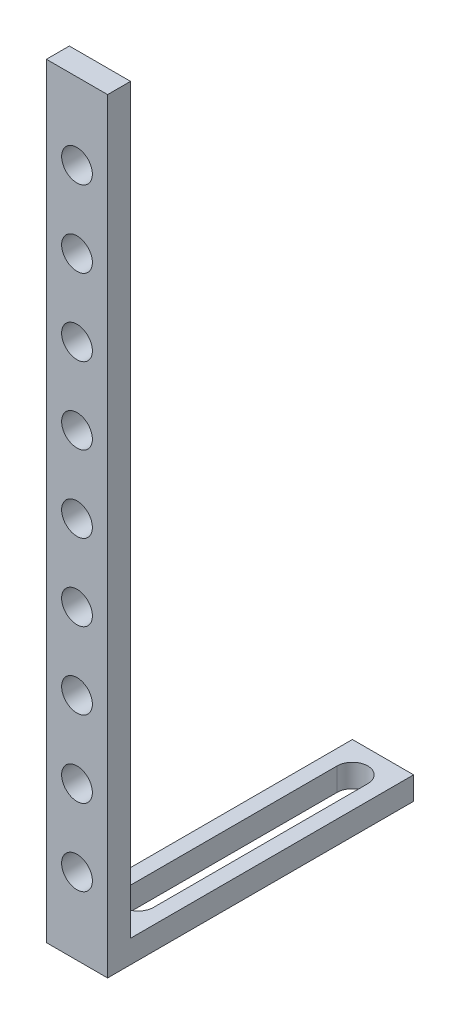
ISO-10303-21;
HEADER;
FILE_DESCRIPTION(('STEP AP214'),'2;1');
FILE_NAME('part.step','',(''),(''),'','','');
FILE_SCHEMA(('AUTOMOTIVE_DESIGN { 1 0 10303 214 1 1 1 1 }'));
ENDSEC;
DATA;
#1=APPLICATION_CONTEXT('core data for automotive mechanical design processes');
#2=APPLICATION_PROTOCOL_DEFINITION('international standard','automotive_design',2000,#1);
#3=PRODUCT_CONTEXT('',#1,'mechanical');
#4=PRODUCT('Part','Part','',(#3));
#5=PRODUCT_RELATED_PRODUCT_CATEGORY('part','',(#4));
#6=PRODUCT_DEFINITION_FORMATION('','',#4);
#7=PRODUCT_DEFINITION_CONTEXT('part definition',#1,'design');
#8=PRODUCT_DEFINITION('design','',#6,#7);
#9=PRODUCT_DEFINITION_SHAPE('','',#8);
#10=(LENGTH_UNIT() NAMED_UNIT(*) SI_UNIT(.MILLI.,.METRE.));
#11=(NAMED_UNIT(*) PLANE_ANGLE_UNIT() SI_UNIT($,.RADIAN.));
#12=(NAMED_UNIT(*) SI_UNIT($,.STERADIAN.) SOLID_ANGLE_UNIT());
#13=UNCERTAINTY_MEASURE_WITH_UNIT(LENGTH_MEASURE(1.E-05),#10,'distance_accuracy_value','');
#14=(GEOMETRIC_REPRESENTATION_CONTEXT(3) GLOBAL_UNCERTAINTY_ASSIGNED_CONTEXT((#13)) GLOBAL_UNIT_ASSIGNED_CONTEXT((#10,
#11,#12)) REPRESENTATION_CONTEXT('',''));
#15=CARTESIAN_POINT('',(0.,0.,0.));
#16=DIRECTION('',(0.,0.,1.));
#17=DIRECTION('',(1.,0.,0.));
#18=AXIS2_PLACEMENT_3D('',#15,#16,#17);
#19=CARTESIAN_POINT('',(40.,0.,-200.));
#20=DIRECTION('',(0.,1.,0.));
#21=DIRECTION('',(0.,0.,1.));
#22=AXIS2_PLACEMENT_3D('',#19,#20,#21);
#23=PLANE('',#22);
#24=DIRECTION('',(0.,0.,-1.));
#25=VECTOR('',#24,1.);
#26=CARTESIAN_POINT('',(9.95,0.,-40.));
#27=LINE('',#26,#25);
#28=CARTESIAN_POINT('',(9.95,0.,-40.));
#29=VERTEX_POINT('',#28);
#30=CARTESIAN_POINT('',(9.95000000000001,0.,-180.));
#31=VERTEX_POINT('',#30);
#32=EDGE_CURVE('E132',#29,#31,#27,.T.);
#33=ORIENTED_EDGE('',*,*,#32,.F.);
#34=CARTESIAN_POINT('',(20.,0.,-40.));
#35=DIRECTION('',(0.,-1.,0.));
#36=DIRECTION('',(0.,0.,1.));
#37=AXIS2_PLACEMENT_3D('',#34,#35,#36);
#38=CIRCLE('',#37,10.05);
#39=CARTESIAN_POINT('',(30.05,0.,-40.));
#40=VERTEX_POINT('',#39);
#41=EDGE_CURVE('E48',#40,#29,#38,.T.);
#42=ORIENTED_EDGE('',*,*,#41,.F.);
#43=DIRECTION('',(0.,0.,1.));
#44=VECTOR('',#43,1.);
#45=CARTESIAN_POINT('',(30.05,0.,-40.));
#46=LINE('',#45,#44);
#47=CARTESIAN_POINT('',(30.05,0.,-180.));
#48=VERTEX_POINT('',#47);
#49=EDGE_CURVE('E118',#48,#40,#46,.T.);
#50=ORIENTED_EDGE('',*,*,#49,.F.);
#51=CARTESIAN_POINT('',(20.,0.,-180.));
#52=DIRECTION('',(0.,-1.,0.));
#53=DIRECTION('',(0.,0.,-1.));
#54=AXIS2_PLACEMENT_3D('',#51,#52,#53);
#55=CIRCLE('',#54,10.05);
#56=EDGE_CURVE('E138',#31,#48,#55,.T.);
#57=ORIENTED_EDGE('',*,*,#56,.F.);
#58=EDGE_LOOP('',(#33,#42,#50,#57));
#59=FACE_BOUND('',#58,.T.);
#60=DIRECTION('',(0.,0.,-1.));
#61=VECTOR('',#60,1.);
#62=CARTESIAN_POINT('',(0.,0.,-200.));
#63=LINE('',#62,#61);
#64=CARTESIAN_POINT('',(0.,0.,0.));
#65=VERTEX_POINT('',#64);
#66=CARTESIAN_POINT('',(0.,0.,-200.));
#67=VERTEX_POINT('',#66);
#68=EDGE_CURVE('E200',#65,#67,#63,.T.);
#69=ORIENTED_EDGE('',*,*,#68,.T.);
#70=DIRECTION('',(-1.,0.,0.));
#71=VECTOR('',#70,1.);
#72=CARTESIAN_POINT('',(40.,0.,-200.));
#73=LINE('',#72,#71);
#74=CARTESIAN_POINT('',(40.,0.,-200.));
#75=VERTEX_POINT('',#74);
#76=EDGE_CURVE('E11',#75,#67,#73,.T.);
#77=ORIENTED_EDGE('',*,*,#76,.F.);
#78=DIRECTION('',(0.,0.,-1.));
#79=VECTOR('',#78,1.);
#80=CARTESIAN_POINT('',(40.,0.,-200.));
#81=LINE('',#80,#79);
#82=CARTESIAN_POINT('',(40.,0.,0.));
#83=VERTEX_POINT('',#82);
#84=EDGE_CURVE('E201',#83,#75,#81,.T.);
#85=ORIENTED_EDGE('',*,*,#84,.F.);
#86=DIRECTION('',(-1.,0.,0.));
#87=VECTOR('',#86,1.);
#88=CARTESIAN_POINT('',(40.,0.,0.));
#89=LINE('',#88,#87);
#90=EDGE_CURVE('E215',#83,#65,#89,.T.);
#91=ORIENTED_EDGE('',*,*,#90,.T.);
#92=EDGE_LOOP('',(#69,#77,#85,#91));
#93=FACE_BOUND('',#92,.T.);
#94=ADVANCED_FACE('F34',(#59,#93),#23,.F.);
#95=CARTESIAN_POINT('',(40.,15.,-200.));
#96=DIRECTION('',(0.,0.,1.));
#97=DIRECTION('',(1.,0.,0.));
#98=AXIS2_PLACEMENT_3D('',#95,#96,#97);
#99=PLANE('',#98);
#100=DIRECTION('',(0.,1.,0.));
#101=VECTOR('',#100,1.);
#102=CARTESIAN_POINT('',(0.,15.,-200.));
#103=LINE('',#102,#101);
#104=CARTESIAN_POINT('',(0.,15.,-200.));
#105=VERTEX_POINT('',#104);
#106=EDGE_CURVE('E218',#67,#105,#103,.T.);
#107=ORIENTED_EDGE('',*,*,#106,.T.);
#108=DIRECTION('',(-1.,0.,0.));
#109=VECTOR('',#108,1.);
#110=CARTESIAN_POINT('',(40.,15.,-200.));
#111=LINE('',#110,#109);
#112=CARTESIAN_POINT('',(40.,15.,-200.));
#113=VERTEX_POINT('',#112);
#114=EDGE_CURVE('E41',#113,#105,#111,.T.);
#115=ORIENTED_EDGE('',*,*,#114,.F.);
#116=DIRECTION('',(0.,1.,0.));
#117=VECTOR('',#116,1.);
#118=CARTESIAN_POINT('',(40.,15.,-200.));
#119=LINE('',#118,#117);
#120=EDGE_CURVE('E204',#75,#113,#119,.T.);
#121=ORIENTED_EDGE('',*,*,#120,.F.);
#122=ORIENTED_EDGE('',*,*,#76,.T.);
#123=EDGE_LOOP('',(#107,#115,#121,#122));
#124=FACE_BOUND('',#123,.T.);
#125=ADVANCED_FACE('F263',(#124),#99,.F.);
#126=CARTESIAN_POINT('',(40.,15.,-15.0000000000001));
#127=DIRECTION('',(0.,-1.,0.));
#128=DIRECTION('',(0.,0.,-1.));
#129=AXIS2_PLACEMENT_3D('',#126,#127,#128);
#130=PLANE('',#129);
#131=DIRECTION('',(0.,0.,-1.));
#132=VECTOR('',#131,1.);
#133=CARTESIAN_POINT('',(30.05,15.,-40.));
#134=LINE('',#133,#132);
#135=CARTESIAN_POINT('',(30.05,15.,-40.));
#136=VERTEX_POINT('',#135);
#137=CARTESIAN_POINT('',(30.05,15.,-180.));
#138=VERTEX_POINT('',#137);
#139=EDGE_CURVE('E130',#136,#138,#134,.T.);
#140=ORIENTED_EDGE('',*,*,#139,.F.);
#141=CARTESIAN_POINT('',(20.,15.,-40.));
#142=DIRECTION('',(0.,-1.,0.));
#143=DIRECTION('',(0.,0.,-1.));
#144=AXIS2_PLACEMENT_3D('',#141,#142,#143);
#145=CIRCLE('',#144,10.05);
#146=CARTESIAN_POINT('',(9.95,15.,-40.));
#147=VERTEX_POINT('',#146);
#148=EDGE_CURVE('E112',#147,#136,#145,.F.);
#149=ORIENTED_EDGE('',*,*,#148,.F.);
#150=DIRECTION('',(0.,0.,1.));
#151=VECTOR('',#150,1.);
#152=CARTESIAN_POINT('',(9.95,15.,-40.));
#153=LINE('',#152,#151);
#154=CARTESIAN_POINT('',(9.95000000000001,15.,-180.));
#155=VERTEX_POINT('',#154);
#156=EDGE_CURVE('E121',#155,#147,#153,.T.);
#157=ORIENTED_EDGE('',*,*,#156,.F.);
#158=CARTESIAN_POINT('',(20.,15.,-180.));
#159=DIRECTION('',(0.,-1.,0.));
#160=DIRECTION('',(0.,0.,-1.));
#161=AXIS2_PLACEMENT_3D('',#158,#159,#160);
#162=CIRCLE('',#161,10.05);
#163=EDGE_CURVE('E56',#138,#155,#162,.F.);
#164=ORIENTED_EDGE('',*,*,#163,.F.);
#165=EDGE_LOOP('',(#140,#149,#157,#164));
#166=FACE_BOUND('',#165,.T.);
#167=DIRECTION('',(0.,0.,1.));
#168=VECTOR('',#167,1.);
#169=CARTESIAN_POINT('',(0.,15.,-15.0000000000001));
#170=LINE('',#169,#168);
#171=CARTESIAN_POINT('',(0.,15.,-15.0000000000001));
#172=VERTEX_POINT('',#171);
#173=EDGE_CURVE('E220',#105,#172,#170,.T.);
#174=ORIENTED_EDGE('',*,*,#173,.T.);
#175=DIRECTION('',(-1.,0.,0.));
#176=VECTOR('',#175,1.);
#177=CARTESIAN_POINT('',(40.,15.,-15.0000000000001));
#178=LINE('',#177,#176);
#179=CARTESIAN_POINT('',(40.,15.,-15.0000000000001));
#180=VERTEX_POINT('',#179);
#181=EDGE_CURVE('E235',#180,#172,#178,.T.);
#182=ORIENTED_EDGE('',*,*,#181,.F.);
#183=DIRECTION('',(0.,0.,1.));
#184=VECTOR('',#183,1.);
#185=CARTESIAN_POINT('',(40.,15.,-15.0000000000001));
#186=LINE('',#185,#184);
#187=EDGE_CURVE('E207',#113,#180,#186,.T.);
#188=ORIENTED_EDGE('',*,*,#187,.F.);
#189=ORIENTED_EDGE('',*,*,#114,.T.);
#190=EDGE_LOOP('',(#174,#182,#188,#189));
#191=FACE_BOUND('',#190,.T.);
#192=ADVANCED_FACE('F127',(#166,#191),#130,.F.);
#193=CARTESIAN_POINT('',(40.,500.,-15.));
#194=DIRECTION('',(0.,0.,1.));
#195=DIRECTION('',(0.,-1.,0.));
#196=AXIS2_PLACEMENT_3D('',#193,#194,#195);
#197=PLANE('',#196);
#198=CARTESIAN_POINT('',(20.,100.,-15.0000000000001));
#199=DIRECTION('',(0.,0.,1.));
#200=DIRECTION('',(0.,-1.,0.));
#201=AXIS2_PLACEMENT_3D('',#198,#199,#200);
#202=CIRCLE('',#201,10.05);
#203=CARTESIAN_POINT('',(20.,89.95,-15.0000000000001));
#204=VERTEX_POINT('',#203);
#205=EDGE_CURVE('E191',#204,#204,#202,.T.);
#206=ORIENTED_EDGE('',*,*,#205,.T.);
#207=EDGE_LOOP('',(#206));
#208=FACE_BOUND('',#207,.T.);
#209=CARTESIAN_POINT('',(20.,150.,-15.0000000000001));
#210=DIRECTION('',(0.,0.,1.));
#211=DIRECTION('',(0.,-1.,0.));
#212=AXIS2_PLACEMENT_3D('',#209,#210,#211);
#213=CIRCLE('',#212,10.05);
#214=CARTESIAN_POINT('',(20.,139.95,-15.0000000000001));
#215=VERTEX_POINT('',#214);
#216=EDGE_CURVE('E188',#215,#215,#213,.T.);
#217=ORIENTED_EDGE('',*,*,#216,.T.);
#218=EDGE_LOOP('',(#217));
#219=FACE_BOUND('',#218,.T.);
#220=CARTESIAN_POINT('',(20.,200.,-15.));
#221=DIRECTION('',(0.,0.,1.));
#222=DIRECTION('',(0.,-1.,0.));
#223=AXIS2_PLACEMENT_3D('',#220,#221,#222);
#224=CIRCLE('',#223,10.05);
#225=CARTESIAN_POINT('',(20.,189.95,-15.));
#226=VERTEX_POINT('',#225);
#227=EDGE_CURVE('E185',#226,#226,#224,.T.);
#228=ORIENTED_EDGE('',*,*,#227,.T.);
#229=EDGE_LOOP('',(#228));
#230=FACE_BOUND('',#229,.T.);
#231=CARTESIAN_POINT('',(20.,250.,-15.));
#232=DIRECTION('',(0.,0.,1.));
#233=DIRECTION('',(0.,-1.,0.));
#234=AXIS2_PLACEMENT_3D('',#231,#232,#233);
#235=CIRCLE('',#234,10.05);
#236=CARTESIAN_POINT('',(20.,239.95,-15.));
#237=VERTEX_POINT('',#236);
#238=EDGE_CURVE('E182',#237,#237,#235,.T.);
#239=ORIENTED_EDGE('',*,*,#238,.T.);
#240=EDGE_LOOP('',(#239));
#241=FACE_BOUND('',#240,.T.);
#242=CARTESIAN_POINT('',(20.,300.,-15.));
#243=DIRECTION('',(0.,0.,1.));
#244=DIRECTION('',(0.,-1.,0.));
#245=AXIS2_PLACEMENT_3D('',#242,#243,#244);
#246=CIRCLE('',#245,10.05);
#247=CARTESIAN_POINT('',(20.,289.95,-15.));
#248=VERTEX_POINT('',#247);
#249=EDGE_CURVE('E179',#248,#248,#246,.T.);
#250=ORIENTED_EDGE('',*,*,#249,.T.);
#251=EDGE_LOOP('',(#250));
#252=FACE_BOUND('',#251,.T.);
#253=CARTESIAN_POINT('',(20.,350.,-15.));
#254=DIRECTION('',(0.,0.,1.));
#255=DIRECTION('',(0.,-1.,0.));
#256=AXIS2_PLACEMENT_3D('',#253,#254,#255);
#257=CIRCLE('',#256,10.05);
#258=CARTESIAN_POINT('',(20.,339.95,-15.));
#259=VERTEX_POINT('',#258);
#260=EDGE_CURVE('E176',#259,#259,#257,.T.);
#261=ORIENTED_EDGE('',*,*,#260,.T.);
#262=EDGE_LOOP('',(#261));
#263=FACE_BOUND('',#262,.T.);
#264=CARTESIAN_POINT('',(20.,400.,-15.));
#265=DIRECTION('',(0.,0.,1.));
#266=DIRECTION('',(0.,-1.,0.));
#267=AXIS2_PLACEMENT_3D('',#264,#265,#266);
#268=CIRCLE('',#267,10.05);
#269=CARTESIAN_POINT('',(20.,389.95,-15.));
#270=VERTEX_POINT('',#269);
#271=EDGE_CURVE('E173',#270,#270,#268,.T.);
#272=ORIENTED_EDGE('',*,*,#271,.T.);
#273=EDGE_LOOP('',(#272));
#274=FACE_BOUND('',#273,.T.);
#275=CARTESIAN_POINT('',(20.,450.,-15.));
#276=DIRECTION('',(0.,0.,1.));
#277=DIRECTION('',(0.,-1.,0.));
#278=AXIS2_PLACEMENT_3D('',#275,#276,#277);
#279=CIRCLE('',#278,10.05);
#280=CARTESIAN_POINT('',(20.,439.95,-15.));
#281=VERTEX_POINT('',#280);
#282=EDGE_CURVE('E150',#281,#281,#279,.T.);
#283=ORIENTED_EDGE('',*,*,#282,.T.);
#284=EDGE_LOOP('',(#283));
#285=FACE_BOUND('',#284,.T.);
#286=CARTESIAN_POINT('',(20.,50.,-15.0000000000001));
#287=DIRECTION('',(0.,0.,1.));
#288=DIRECTION('',(0.,-1.,0.));
#289=AXIS2_PLACEMENT_3D('',#286,#287,#288);
#290=CIRCLE('',#289,10.05);
#291=CARTESIAN_POINT('',(20.,39.95,-15.0000000000001));
#292=VERTEX_POINT('',#291);
#293=EDGE_CURVE('E197',#292,#292,#290,.T.);
#294=ORIENTED_EDGE('',*,*,#293,.T.);
#295=EDGE_LOOP('',(#294));
#296=FACE_BOUND('',#295,.T.);
#297=DIRECTION('',(0.,1.,0.));
#298=VECTOR('',#297,1.);
#299=CARTESIAN_POINT('',(0.,500.,-15.));
#300=LINE('',#299,#298);
#301=CARTESIAN_POINT('',(0.,500.,-15.));
#302=VERTEX_POINT('',#301);
#303=EDGE_CURVE('E222',#172,#302,#300,.T.);
#304=ORIENTED_EDGE('',*,*,#303,.T.);
#305=DIRECTION('',(-1.,0.,0.));
#306=VECTOR('',#305,1.);
#307=CARTESIAN_POINT('',(40.,500.,-15.));
#308=LINE('',#307,#306);
#309=CARTESIAN_POINT('',(40.,500.,-15.));
#310=VERTEX_POINT('',#309);
#311=EDGE_CURVE('E232',#310,#302,#308,.T.);
#312=ORIENTED_EDGE('',*,*,#311,.F.);
#313=DIRECTION('',(0.,1.,0.));
#314=VECTOR('',#313,1.);
#315=CARTESIAN_POINT('',(40.,500.,-15.));
#316=LINE('',#315,#314);
#317=EDGE_CURVE('E209',#180,#310,#316,.T.);
#318=ORIENTED_EDGE('',*,*,#317,.F.);
#319=ORIENTED_EDGE('',*,*,#181,.T.);
#320=EDGE_LOOP('',(#304,#312,#318,#319));
#321=FACE_BOUND('',#320,.T.);
#322=ADVANCED_FACE('F251',(#208,#219,#230,#241,#252,#263,#274,#285,#296,#321),#197,.F.);
#323=CARTESIAN_POINT('',(40.,500.,0.));
#324=DIRECTION('',(0.,-1.,0.));
#325=DIRECTION('',(0.,0.,-1.));
#326=AXIS2_PLACEMENT_3D('',#323,#324,#325);
#327=PLANE('',#326);
#328=DIRECTION('',(0.,0.,1.));
#329=VECTOR('',#328,1.);
#330=CARTESIAN_POINT('',(0.,500.,0.));
#331=LINE('',#330,#329);
#332=CARTESIAN_POINT('',(0.,500.,0.));
#333=VERTEX_POINT('',#332);
#334=EDGE_CURVE('E224',#302,#333,#331,.T.);
#335=ORIENTED_EDGE('',*,*,#334,.T.);
#336=DIRECTION('',(-1.,0.,0.));
#337=VECTOR('',#336,1.);
#338=CARTESIAN_POINT('',(40.,500.,0.));
#339=LINE('',#338,#337);
#340=CARTESIAN_POINT('',(40.,500.,0.));
#341=VERTEX_POINT('',#340);
#342=EDGE_CURVE('E229',#341,#333,#339,.T.);
#343=ORIENTED_EDGE('',*,*,#342,.F.);
#344=DIRECTION('',(0.,0.,1.));
#345=VECTOR('',#344,1.);
#346=CARTESIAN_POINT('',(40.,500.,0.));
#347=LINE('',#346,#345);
#348=EDGE_CURVE('E211',#310,#341,#347,.T.);
#349=ORIENTED_EDGE('',*,*,#348,.F.);
#350=ORIENTED_EDGE('',*,*,#311,.T.);
#351=EDGE_LOOP('',(#335,#343,#349,#350));
#352=FACE_BOUND('',#351,.T.);
#353=ADVANCED_FACE('F255',(#352),#327,.F.);
#354=CARTESIAN_POINT('',(40.,0.,0.));
#355=DIRECTION('',(0.,0.,-1.));
#356=DIRECTION('',(-1.,0.,0.));
#357=AXIS2_PLACEMENT_3D('',#354,#355,#356);
#358=PLANE('',#357);
#359=CARTESIAN_POINT('',(20.,100.,0.));
#360=DIRECTION('',(0.,0.,1.));
#361=DIRECTION('',(1.,0.,0.));
#362=AXIS2_PLACEMENT_3D('',#359,#360,#361);
#363=CIRCLE('',#362,10.05);
#364=CARTESIAN_POINT('',(30.05,100.,0.));
#365=VERTEX_POINT('',#364);
#366=EDGE_CURVE('E147',#365,#365,#363,.T.);
#367=ORIENTED_EDGE('',*,*,#366,.F.);
#368=EDGE_LOOP('',(#367));
#369=FACE_BOUND('',#368,.T.);
#370=CARTESIAN_POINT('',(20.,150.,0.));
#371=DIRECTION('',(0.,0.,1.));
#372=DIRECTION('',(1.,0.,0.));
#373=AXIS2_PLACEMENT_3D('',#370,#371,#372);
#374=CIRCLE('',#373,10.05);
#375=CARTESIAN_POINT('',(30.05,150.,0.));
#376=VERTEX_POINT('',#375);
#377=EDGE_CURVE('E151',#376,#376,#374,.T.);
#378=ORIENTED_EDGE('',*,*,#377,.F.);
#379=EDGE_LOOP('',(#378));
#380=FACE_BOUND('',#379,.T.);
#381=CARTESIAN_POINT('',(20.,200.,0.));
#382=DIRECTION('',(0.,0.,1.));
#383=DIRECTION('',(1.,0.,0.));
#384=AXIS2_PLACEMENT_3D('',#381,#382,#383);
#385=CIRCLE('',#384,10.05);
#386=CARTESIAN_POINT('',(30.05,200.,0.));
#387=VERTEX_POINT('',#386);
#388=EDGE_CURVE('E154',#387,#387,#385,.T.);
#389=ORIENTED_EDGE('',*,*,#388,.F.);
#390=EDGE_LOOP('',(#389));
#391=FACE_BOUND('',#390,.T.);
#392=CARTESIAN_POINT('',(20.,250.,0.));
#393=DIRECTION('',(0.,0.,1.));
#394=DIRECTION('',(1.,0.,0.));
#395=AXIS2_PLACEMENT_3D('',#392,#393,#394);
#396=CIRCLE('',#395,10.05);
#397=CARTESIAN_POINT('',(30.05,250.,0.));
#398=VERTEX_POINT('',#397);
#399=EDGE_CURVE('E157',#398,#398,#396,.T.);
#400=ORIENTED_EDGE('',*,*,#399,.F.);
#401=EDGE_LOOP('',(#400));
#402=FACE_BOUND('',#401,.T.);
#403=CARTESIAN_POINT('',(20.,300.,0.));
#404=DIRECTION('',(0.,0.,1.));
#405=DIRECTION('',(1.,0.,0.));
#406=AXIS2_PLACEMENT_3D('',#403,#404,#405);
#407=CIRCLE('',#406,10.05);
#408=CARTESIAN_POINT('',(30.05,300.,0.));
#409=VERTEX_POINT('',#408);
#410=EDGE_CURVE('E160',#409,#409,#407,.T.);
#411=ORIENTED_EDGE('',*,*,#410,.F.);
#412=EDGE_LOOP('',(#411));
#413=FACE_BOUND('',#412,.T.);
#414=CARTESIAN_POINT('',(20.,350.,0.));
#415=DIRECTION('',(0.,0.,1.));
#416=DIRECTION('',(1.,0.,0.));
#417=AXIS2_PLACEMENT_3D('',#414,#415,#416);
#418=CIRCLE('',#417,10.05);
#419=CARTESIAN_POINT('',(30.05,350.,0.));
#420=VERTEX_POINT('',#419);
#421=EDGE_CURVE('E163',#420,#420,#418,.T.);
#422=ORIENTED_EDGE('',*,*,#421,.F.);
#423=EDGE_LOOP('',(#422));
#424=FACE_BOUND('',#423,.T.);
#425=CARTESIAN_POINT('',(20.,400.,0.));
#426=DIRECTION('',(0.,0.,1.));
#427=DIRECTION('',(1.,0.,0.));
#428=AXIS2_PLACEMENT_3D('',#425,#426,#427);
#429=CIRCLE('',#428,10.05);
#430=CARTESIAN_POINT('',(30.05,400.,0.));
#431=VERTEX_POINT('',#430);
#432=EDGE_CURVE('E166',#431,#431,#429,.T.);
#433=ORIENTED_EDGE('',*,*,#432,.F.);
#434=EDGE_LOOP('',(#433));
#435=FACE_BOUND('',#434,.T.);
#436=CARTESIAN_POINT('',(20.,450.,0.));
#437=DIRECTION('',(0.,0.,1.));
#438=DIRECTION('',(1.,0.,0.));
#439=AXIS2_PLACEMENT_3D('',#436,#437,#438);
#440=CIRCLE('',#439,10.05);
#441=CARTESIAN_POINT('',(30.05,450.,0.));
#442=VERTEX_POINT('',#441);
#443=EDGE_CURVE('E124',#442,#442,#440,.T.);
#444=ORIENTED_EDGE('',*,*,#443,.F.);
#445=EDGE_LOOP('',(#444));
#446=FACE_BOUND('',#445,.T.);
#447=CARTESIAN_POINT('',(20.,50.,0.));
#448=DIRECTION('',(0.,0.,1.));
#449=DIRECTION('',(1.,0.,0.));
#450=AXIS2_PLACEMENT_3D('',#447,#448,#449);
#451=CIRCLE('',#450,10.05);
#452=CARTESIAN_POINT('',(30.05,50.,0.));
#453=VERTEX_POINT('',#452);
#454=EDGE_CURVE('E194',#453,#453,#451,.T.);
#455=ORIENTED_EDGE('',*,*,#454,.F.);
#456=EDGE_LOOP('',(#455));
#457=FACE_BOUND('',#456,.T.);
#458=DIRECTION('',(0.,-1.,0.));
#459=VECTOR('',#458,1.);
#460=CARTESIAN_POINT('',(0.,0.,0.));
#461=LINE('',#460,#459);
#462=EDGE_CURVE('E205',#333,#65,#461,.T.);
#463=ORIENTED_EDGE('',*,*,#462,.T.);
#464=ORIENTED_EDGE('',*,*,#90,.F.);
#465=DIRECTION('',(0.,-1.,0.));
#466=VECTOR('',#465,1.);
#467=CARTESIAN_POINT('',(40.,0.,0.));
#468=LINE('',#467,#466);
#469=EDGE_CURVE('E213',#341,#83,#468,.T.);
#470=ORIENTED_EDGE('',*,*,#469,.F.);
#471=ORIENTED_EDGE('',*,*,#342,.T.);
#472=EDGE_LOOP('',(#463,#464,#470,#471));
#473=FACE_BOUND('',#472,.T.);
#474=ADVANCED_FACE('F266',(#369,#380,#391,#402,#413,#424,#435,#446,#457,#473),#358,.F.);
#475=CARTESIAN_POINT('',(40.,0.,0.));
#476=DIRECTION('',(-1.,0.,0.));
#477=DIRECTION('',(0.,0.,1.));
#478=AXIS2_PLACEMENT_3D('',#475,#476,#477);
#479=PLANE('',#478);
#480=ORIENTED_EDGE('',*,*,#84,.T.);
#481=ORIENTED_EDGE('',*,*,#120,.T.);
#482=ORIENTED_EDGE('',*,*,#187,.T.);
#483=ORIENTED_EDGE('',*,*,#317,.T.);
#484=ORIENTED_EDGE('',*,*,#348,.T.);
#485=ORIENTED_EDGE('',*,*,#469,.T.);
#486=EDGE_LOOP('',(#480,#481,#482,#483,#484,#485));
#487=FACE_BOUND('',#486,.T.);
#488=ADVANCED_FACE('F259',(#487),#479,.F.);
#489=CARTESIAN_POINT('',(0.,0.,0.));
#490=DIRECTION('',(-1.,0.,0.));
#491=DIRECTION('',(0.,0.,1.));
#492=AXIS2_PLACEMENT_3D('',#489,#490,#491);
#493=PLANE('',#492);
#494=ORIENTED_EDGE('',*,*,#68,.F.);
#495=ORIENTED_EDGE('',*,*,#462,.F.);
#496=ORIENTED_EDGE('',*,*,#334,.F.);
#497=ORIENTED_EDGE('',*,*,#303,.F.);
#498=ORIENTED_EDGE('',*,*,#173,.F.);
#499=ORIENTED_EDGE('',*,*,#106,.F.);
#500=EDGE_LOOP('',(#494,#495,#496,#497,#498,#499));
#501=FACE_BOUND('',#500,.T.);
#502=ADVANCED_FACE('F246',(#501),#493,.T.);
#503=CARTESIAN_POINT('',(20.,50.,-200.));
#504=DIRECTION('',(0.,0.,1.));
#505=DIRECTION('',(1.,0.,0.));
#506=AXIS2_PLACEMENT_3D('',#503,#504,#505);
#507=CYLINDRICAL_SURFACE('',#506,10.05);
#508=ORIENTED_EDGE('',*,*,#454,.T.);
#509=EDGE_LOOP('',(#508));
#510=FACE_BOUND('',#509,.T.);
#511=ORIENTED_EDGE('',*,*,#293,.F.);
#512=EDGE_LOOP('',(#511));
#513=FACE_BOUND('',#512,.T.);
#514=ADVANCED_FACE('F331',(#510,#513),#507,.F.);
#515=CARTESIAN_POINT('',(20.,450.,-200.));
#516=DIRECTION('',(0.,0.,1.));
#517=DIRECTION('',(1.,0.,0.));
#518=AXIS2_PLACEMENT_3D('',#515,#516,#517);
#519=CYLINDRICAL_SURFACE('',#518,10.05);
#520=ORIENTED_EDGE('',*,*,#443,.T.);
#521=EDGE_LOOP('',(#520));
#522=FACE_BOUND('',#521,.T.);
#523=ORIENTED_EDGE('',*,*,#282,.F.);
#524=EDGE_LOOP('',(#523));
#525=FACE_BOUND('',#524,.T.);
#526=ADVANCED_FACE('F327',(#522,#525),#519,.F.);
#527=CARTESIAN_POINT('',(20.,400.,-200.));
#528=DIRECTION('',(0.,0.,1.));
#529=DIRECTION('',(1.,0.,0.));
#530=AXIS2_PLACEMENT_3D('',#527,#528,#529);
#531=CYLINDRICAL_SURFACE('',#530,10.05);
#532=ORIENTED_EDGE('',*,*,#432,.T.);
#533=EDGE_LOOP('',(#532));
#534=FACE_BOUND('',#533,.T.);
#535=ORIENTED_EDGE('',*,*,#271,.F.);
#536=EDGE_LOOP('',(#535));
#537=FACE_BOUND('',#536,.T.);
#538=ADVANCED_FACE('F323',(#534,#537),#531,.F.);
#539=CARTESIAN_POINT('',(20.,350.,-200.));
#540=DIRECTION('',(0.,0.,1.));
#541=DIRECTION('',(1.,0.,0.));
#542=AXIS2_PLACEMENT_3D('',#539,#540,#541);
#543=CYLINDRICAL_SURFACE('',#542,10.05);
#544=ORIENTED_EDGE('',*,*,#421,.T.);
#545=EDGE_LOOP('',(#544));
#546=FACE_BOUND('',#545,.T.);
#547=ORIENTED_EDGE('',*,*,#260,.F.);
#548=EDGE_LOOP('',(#547));
#549=FACE_BOUND('',#548,.T.);
#550=ADVANCED_FACE('F319',(#546,#549),#543,.F.);
#551=CARTESIAN_POINT('',(20.,300.,-200.));
#552=DIRECTION('',(0.,0.,1.));
#553=DIRECTION('',(1.,0.,0.));
#554=AXIS2_PLACEMENT_3D('',#551,#552,#553);
#555=CYLINDRICAL_SURFACE('',#554,10.05);
#556=ORIENTED_EDGE('',*,*,#410,.T.);
#557=EDGE_LOOP('',(#556));
#558=FACE_BOUND('',#557,.T.);
#559=ORIENTED_EDGE('',*,*,#249,.F.);
#560=EDGE_LOOP('',(#559));
#561=FACE_BOUND('',#560,.T.);
#562=ADVANCED_FACE('F315',(#558,#561),#555,.F.);
#563=CARTESIAN_POINT('',(20.,250.,-200.));
#564=DIRECTION('',(0.,0.,1.));
#565=DIRECTION('',(1.,0.,0.));
#566=AXIS2_PLACEMENT_3D('',#563,#564,#565);
#567=CYLINDRICAL_SURFACE('',#566,10.05);
#568=ORIENTED_EDGE('',*,*,#399,.T.);
#569=EDGE_LOOP('',(#568));
#570=FACE_BOUND('',#569,.T.);
#571=ORIENTED_EDGE('',*,*,#238,.F.);
#572=EDGE_LOOP('',(#571));
#573=FACE_BOUND('',#572,.T.);
#574=ADVANCED_FACE('F311',(#570,#573),#567,.F.);
#575=CARTESIAN_POINT('',(20.,200.,-200.));
#576=DIRECTION('',(0.,0.,1.));
#577=DIRECTION('',(1.,0.,0.));
#578=AXIS2_PLACEMENT_3D('',#575,#576,#577);
#579=CYLINDRICAL_SURFACE('',#578,10.05);
#580=ORIENTED_EDGE('',*,*,#388,.T.);
#581=EDGE_LOOP('',(#580));
#582=FACE_BOUND('',#581,.T.);
#583=ORIENTED_EDGE('',*,*,#227,.F.);
#584=EDGE_LOOP('',(#583));
#585=FACE_BOUND('',#584,.T.);
#586=ADVANCED_FACE('F307',(#582,#585),#579,.F.);
#587=CARTESIAN_POINT('',(20.,150.,-200.));
#588=DIRECTION('',(0.,0.,1.));
#589=DIRECTION('',(1.,0.,0.));
#590=AXIS2_PLACEMENT_3D('',#587,#588,#589);
#591=CYLINDRICAL_SURFACE('',#590,10.05);
#592=ORIENTED_EDGE('',*,*,#377,.T.);
#593=EDGE_LOOP('',(#592));
#594=FACE_BOUND('',#593,.T.);
#595=ORIENTED_EDGE('',*,*,#216,.F.);
#596=EDGE_LOOP('',(#595));
#597=FACE_BOUND('',#596,.T.);
#598=ADVANCED_FACE('F303',(#594,#597),#591,.F.);
#599=CARTESIAN_POINT('',(20.,100.,-200.));
#600=DIRECTION('',(0.,0.,1.));
#601=DIRECTION('',(1.,0.,0.));
#602=AXIS2_PLACEMENT_3D('',#599,#600,#601);
#603=CYLINDRICAL_SURFACE('',#602,10.05);
#604=ORIENTED_EDGE('',*,*,#366,.T.);
#605=EDGE_LOOP('',(#604));
#606=FACE_BOUND('',#605,.T.);
#607=ORIENTED_EDGE('',*,*,#205,.F.);
#608=EDGE_LOOP('',(#607));
#609=FACE_BOUND('',#608,.T.);
#610=ADVANCED_FACE('F296',(#606,#609),#603,.F.);
#611=CARTESIAN_POINT('',(20.,500.001,-40.));
#612=DIRECTION('',(0.,-1.,0.));
#613=DIRECTION('',(0.,0.,-1.));
#614=AXIS2_PLACEMENT_3D('',#611,#612,#613);
#615=CYLINDRICAL_SURFACE('',#614,10.05);
#616=ORIENTED_EDGE('',*,*,#148,.T.);
#617=DIRECTION('',(0.,-1.,0.));
#618=VECTOR('',#617,1.);
#619=CARTESIAN_POINT('',(30.05,500.001,-40.));
#620=LINE('',#619,#618);
#621=EDGE_CURVE('E125',#136,#40,#620,.T.);
#622=ORIENTED_EDGE('',*,*,#621,.T.);
#623=ORIENTED_EDGE('',*,*,#41,.T.);
#624=DIRECTION('',(0.,-1.,0.));
#625=VECTOR('',#624,1.);
#626=CARTESIAN_POINT('',(9.95,500.001,-40.));
#627=LINE('',#626,#625);
#628=EDGE_CURVE('E108',#147,#29,#627,.T.);
#629=ORIENTED_EDGE('',*,*,#628,.F.);
#630=EDGE_LOOP('',(#616,#622,#623,#629));
#631=FACE_BOUND('',#630,.T.);
#632=ADVANCED_FACE('F110',(#631),#615,.F.);
#633=CARTESIAN_POINT('',(30.05,500.001,-40.));
#634=DIRECTION('',(1.,0.,0.));
#635=DIRECTION('',(0.,0.,-1.));
#636=AXIS2_PLACEMENT_3D('',#633,#634,#635);
#637=PLANE('',#636);
#638=ORIENTED_EDGE('',*,*,#139,.T.);
#639=DIRECTION('',(0.,-1.,0.));
#640=VECTOR('',#639,1.);
#641=CARTESIAN_POINT('',(30.05,500.001,-180.));
#642=LINE('',#641,#640);
#643=EDGE_CURVE('E144',#138,#48,#642,.T.);
#644=ORIENTED_EDGE('',*,*,#643,.T.);
#645=ORIENTED_EDGE('',*,*,#49,.T.);
#646=ORIENTED_EDGE('',*,*,#621,.F.);
#647=EDGE_LOOP('',(#638,#644,#645,#646));
#648=FACE_BOUND('',#647,.T.);
#649=ADVANCED_FACE('F288',(#648),#637,.F.);
#650=CARTESIAN_POINT('',(20.,500.001,-180.));
#651=DIRECTION('',(0.,-1.,0.));
#652=DIRECTION('',(0.,0.,-1.));
#653=AXIS2_PLACEMENT_3D('',#650,#651,#652);
#654=CYLINDRICAL_SURFACE('',#653,10.05);
#655=ORIENTED_EDGE('',*,*,#163,.T.);
#656=DIRECTION('',(0.,-1.,0.));
#657=VECTOR('',#656,1.);
#658=CARTESIAN_POINT('',(9.95000000000001,500.001,-180.));
#659=LINE('',#658,#657);
#660=EDGE_CURVE('E117',#155,#31,#659,.T.);
#661=ORIENTED_EDGE('',*,*,#660,.T.);
#662=ORIENTED_EDGE('',*,*,#56,.T.);
#663=ORIENTED_EDGE('',*,*,#643,.F.);
#664=EDGE_LOOP('',(#655,#661,#662,#663));
#665=FACE_BOUND('',#664,.T.);
#666=ADVANCED_FACE('F286',(#665),#654,.F.);
#667=CARTESIAN_POINT('',(9.95,500.001,-40.));
#668=DIRECTION('',(-1.,0.,0.));
#669=DIRECTION('',(0.,0.,1.));
#670=AXIS2_PLACEMENT_3D('',#667,#668,#669);
#671=PLANE('',#670);
#672=ORIENTED_EDGE('',*,*,#156,.T.);
#673=ORIENTED_EDGE('',*,*,#628,.T.);
#674=ORIENTED_EDGE('',*,*,#32,.T.);
#675=ORIENTED_EDGE('',*,*,#660,.F.);
#676=EDGE_LOOP('',(#672,#673,#674,#675));
#677=FACE_BOUND('',#676,.T.);
#678=ADVANCED_FACE('F122',(#677),#671,.F.);
#679=CLOSED_SHELL('',(#94,#125,#192,#322,#353,#474,#488,#502,#514,#526,#538,#550,#562,#574,#586,
#598,#610,#632,#649,#666,#678));
#680=MANIFOLD_SOLID_BREP('B2',#679);
#681=ADVANCED_BREP_SHAPE_REPRESENTATION('',(#18,#680),#14);
#682=SHAPE_DEFINITION_REPRESENTATION(#9,#681);
ENDSEC;
END-ISO-10303-21;
